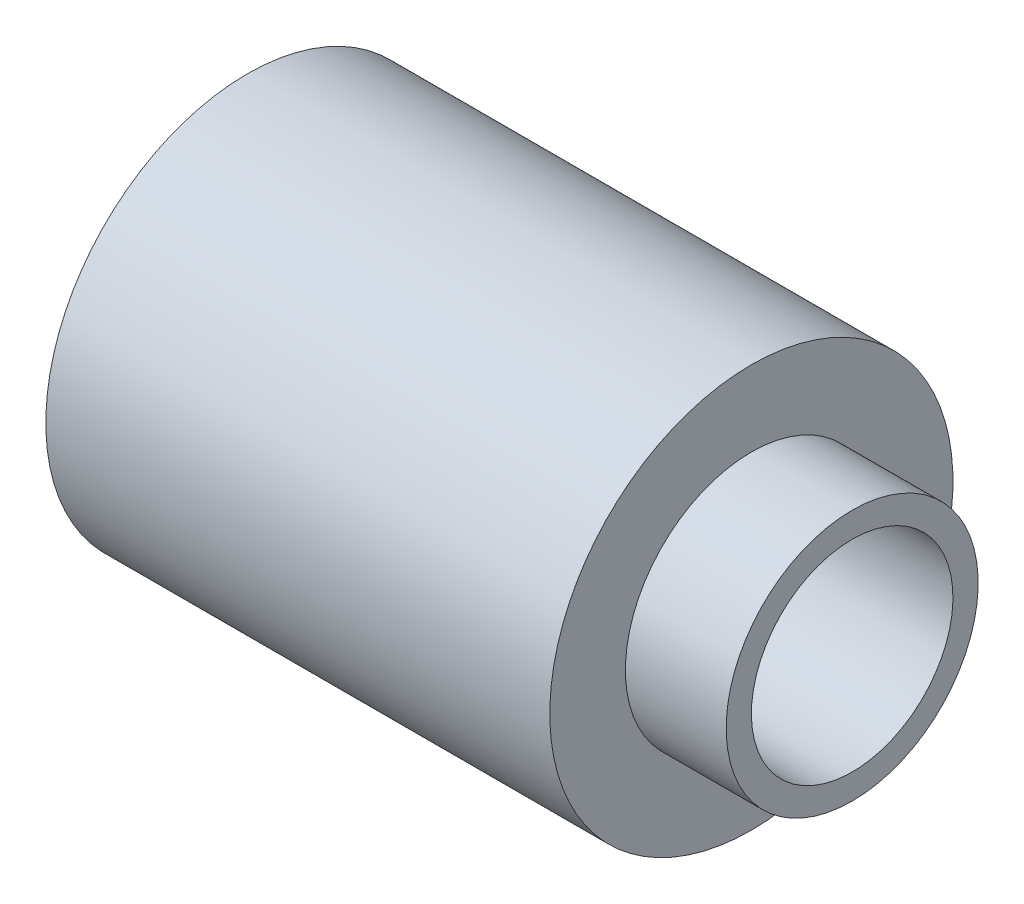
ISO-10303-21;
HEADER;
FILE_DESCRIPTION(('STEP AP214'),'2;1');
FILE_NAME('part.step','',(''),(''),'','','');
FILE_SCHEMA(('AUTOMOTIVE_DESIGN { 1 0 10303 214 1 1 1 1 }'));
ENDSEC;
DATA;
#1=APPLICATION_CONTEXT('core data for automotive mechanical design processes');
#2=APPLICATION_PROTOCOL_DEFINITION('international standard','automotive_design',2000,#1);
#3=PRODUCT_CONTEXT('',#1,'mechanical');
#4=PRODUCT('Part','Part','',(#3));
#5=PRODUCT_RELATED_PRODUCT_CATEGORY('part','',(#4));
#6=PRODUCT_DEFINITION_FORMATION('','',#4);
#7=PRODUCT_DEFINITION_CONTEXT('part definition',#1,'design');
#8=PRODUCT_DEFINITION('design','',#6,#7);
#9=PRODUCT_DEFINITION_SHAPE('','',#8);
#10=(LENGTH_UNIT() NAMED_UNIT(*) SI_UNIT(.MILLI.,.METRE.));
#11=(NAMED_UNIT(*) PLANE_ANGLE_UNIT() SI_UNIT($,.RADIAN.));
#12=(NAMED_UNIT(*) SI_UNIT($,.STERADIAN.) SOLID_ANGLE_UNIT());
#13=UNCERTAINTY_MEASURE_WITH_UNIT(LENGTH_MEASURE(1.E-05),#10,'distance_accuracy_value','');
#14=(GEOMETRIC_REPRESENTATION_CONTEXT(3) GLOBAL_UNCERTAINTY_ASSIGNED_CONTEXT((#13)) GLOBAL_UNIT_ASSIGNED_CONTEXT((#10,
#11,#12)) REPRESENTATION_CONTEXT('',''));
#15=CARTESIAN_POINT('',(0.,0.,0.));
#16=DIRECTION('',(0.,0.,1.));
#17=DIRECTION('',(1.,0.,0.));
#18=AXIS2_PLACEMENT_3D('',#15,#16,#17);
#19=CARTESIAN_POINT('',(0.,2.5,0.));
#20=DIRECTION('',(1.,0.,0.));
#21=DIRECTION('',(0.,1.,0.));
#22=AXIS2_PLACEMENT_3D('',#19,#20,#21);
#23=PLANE('',#22);
#24=CARTESIAN_POINT('',(0.,0.,0.));
#25=DIRECTION('',(1.,0.,0.));
#26=DIRECTION('',(0.,1.,0.));
#27=AXIS2_PLACEMENT_3D('',#24,#25,#26);
#28=CIRCLE('',#27,2.);
#29=CARTESIAN_POINT('',(0.,2.,0.));
#30=VERTEX_POINT('',#29);
#31=EDGE_CURVE('E63',#30,#30,#28,.T.);
#32=ORIENTED_EDGE('',*,*,#31,.F.);
#33=EDGE_LOOP('',(#32));
#34=FACE_BOUND('',#33,.T.);
#35=CARTESIAN_POINT('',(0.,0.,0.));
#36=DIRECTION('',(1.,0.,0.));
#37=DIRECTION('',(0.,1.,0.));
#38=AXIS2_PLACEMENT_3D('',#35,#36,#37);
#39=CIRCLE('',#38,2.5);
#40=CARTESIAN_POINT('',(0.,2.5,0.));
#41=VERTEX_POINT('',#40);
#42=EDGE_CURVE('E57',#41,#41,#39,.T.);
#43=ORIENTED_EDGE('',*,*,#42,.T.);
#44=EDGE_LOOP('',(#43));
#45=FACE_BOUND('',#44,.T.);
#46=ADVANCED_FACE('F43',(#34,#45),#23,.T.);
#47=CARTESIAN_POINT('',(-12.,0.,0.));
#48=DIRECTION('',(-1.,0.,0.));
#49=DIRECTION('',(0.,-1.,0.));
#50=AXIS2_PLACEMENT_3D('',#47,#48,#49);
#51=PLANE('',#50);
#52=CARTESIAN_POINT('',(-12.,0.,0.));
#53=DIRECTION('',(1.,0.,0.));
#54=DIRECTION('',(0.,1.,0.));
#55=AXIS2_PLACEMENT_3D('',#52,#53,#54);
#56=CIRCLE('',#55,2.);
#57=CARTESIAN_POINT('',(-12.,2.,0.));
#58=VERTEX_POINT('',#57);
#59=EDGE_CURVE('E62',#58,#58,#56,.T.);
#60=ORIENTED_EDGE('',*,*,#59,.T.);
#61=EDGE_LOOP('',(#60));
#62=FACE_BOUND('',#61,.T.);
#63=CARTESIAN_POINT('',(-12.,0.,0.));
#64=DIRECTION('',(1.,0.,0.));
#65=DIRECTION('',(0.,1.,0.));
#66=AXIS2_PLACEMENT_3D('',#63,#64,#65);
#67=CIRCLE('',#66,4.);
#68=CARTESIAN_POINT('',(-12.,4.,0.));
#69=VERTEX_POINT('',#68);
#70=EDGE_CURVE('E10',#69,#69,#67,.T.);
#71=ORIENTED_EDGE('',*,*,#70,.F.);
#72=EDGE_LOOP('',(#71));
#73=FACE_BOUND('',#72,.T.);
#74=ADVANCED_FACE('F69',(#62,#73),#51,.T.);
#75=CARTESIAN_POINT('',(0.,0.,0.));
#76=DIRECTION('',(1.,0.,0.));
#77=DIRECTION('',(0.,1.,0.));
#78=AXIS2_PLACEMENT_3D('',#75,#76,#77);
#79=CYLINDRICAL_SURFACE('',#78,4.);
#80=ORIENTED_EDGE('',*,*,#70,.T.);
#81=EDGE_LOOP('',(#80));
#82=FACE_BOUND('',#81,.T.);
#83=CARTESIAN_POINT('',(-2.,0.,0.));
#84=DIRECTION('',(1.,0.,0.));
#85=DIRECTION('',(0.,1.,0.));
#86=AXIS2_PLACEMENT_3D('',#83,#84,#85);
#87=CIRCLE('',#86,4.);
#88=CARTESIAN_POINT('',(-2.,4.,0.));
#89=VERTEX_POINT('',#88);
#90=EDGE_CURVE('E49',#89,#89,#87,.T.);
#91=ORIENTED_EDGE('',*,*,#90,.F.);
#92=EDGE_LOOP('',(#91));
#93=FACE_BOUND('',#92,.T.);
#94=ADVANCED_FACE('F90',(#82,#93),#79,.T.);
#95=CARTESIAN_POINT('',(-2.,4.,0.));
#96=DIRECTION('',(1.,0.,0.));
#97=DIRECTION('',(0.,1.,0.));
#98=AXIS2_PLACEMENT_3D('',#95,#96,#97);
#99=PLANE('',#98);
#100=ORIENTED_EDGE('',*,*,#90,.T.);
#101=EDGE_LOOP('',(#100));
#102=FACE_BOUND('',#101,.T.);
#103=CARTESIAN_POINT('',(-2.,0.,0.));
#104=DIRECTION('',(1.,0.,0.));
#105=DIRECTION('',(0.,1.,0.));
#106=AXIS2_PLACEMENT_3D('',#103,#104,#105);
#107=CIRCLE('',#106,2.5);
#108=CARTESIAN_POINT('',(-2.,2.5,0.));
#109=VERTEX_POINT('',#108);
#110=EDGE_CURVE('E53',#109,#109,#107,.T.);
#111=ORIENTED_EDGE('',*,*,#110,.F.);
#112=EDGE_LOOP('',(#111));
#113=FACE_BOUND('',#112,.T.);
#114=ADVANCED_FACE('F84',(#102,#113),#99,.T.);
#115=CARTESIAN_POINT('',(0.,0.,0.));
#116=DIRECTION('',(1.,0.,0.));
#117=DIRECTION('',(0.,1.,0.));
#118=AXIS2_PLACEMENT_3D('',#115,#116,#117);
#119=CYLINDRICAL_SURFACE('',#118,2.5);
#120=ORIENTED_EDGE('',*,*,#110,.T.);
#121=EDGE_LOOP('',(#120));
#122=FACE_BOUND('',#121,.T.);
#123=ORIENTED_EDGE('',*,*,#42,.F.);
#124=EDGE_LOOP('',(#123));
#125=FACE_BOUND('',#124,.T.);
#126=ADVANCED_FACE('F75',(#122,#125),#119,.T.);
#127=CARTESIAN_POINT('',(-12.,0.,0.));
#128=DIRECTION('',(1.,0.,0.));
#129=DIRECTION('',(0.,1.,0.));
#130=AXIS2_PLACEMENT_3D('',#127,#128,#129);
#131=CYLINDRICAL_SURFACE('',#130,2.);
#132=ORIENTED_EDGE('',*,*,#59,.F.);
#133=EDGE_LOOP('',(#132));
#134=FACE_BOUND('',#133,.T.);
#135=ORIENTED_EDGE('',*,*,#31,.T.);
#136=EDGE_LOOP('',(#135));
#137=FACE_BOUND('',#136,.T.);
#138=ADVANCED_FACE('F72',(#134,#137),#131,.F.);
#139=CLOSED_SHELL('',(#46,#74,#94,#114,#126,#138));
#140=MANIFOLD_SOLID_BREP('B2',#139);
#141=ADVANCED_BREP_SHAPE_REPRESENTATION('',(#18,#140),#14);
#142=SHAPE_DEFINITION_REPRESENTATION(#9,#141);
ENDSEC;
END-ISO-10303-21;
